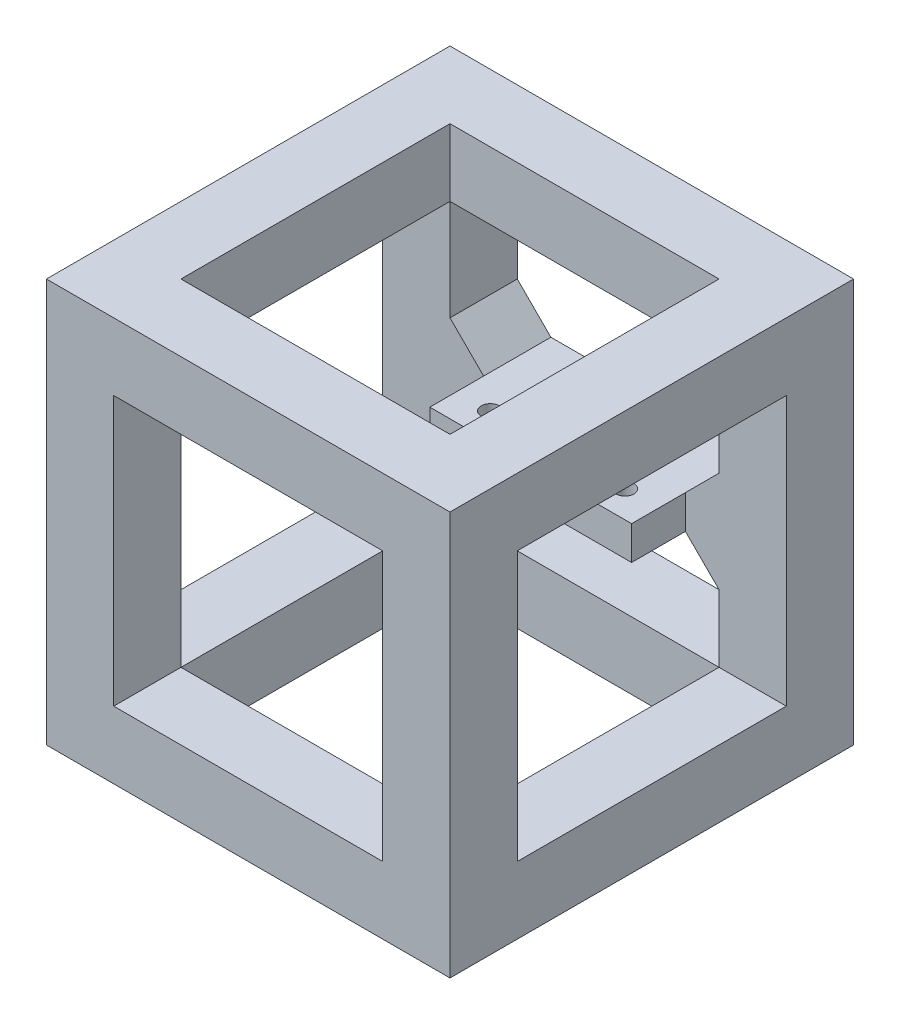
ISO-10303-21;
HEADER;
FILE_DESCRIPTION(('STEP AP214'),'2;1');
FILE_NAME('part.step','',(''),(''),'','','');
FILE_SCHEMA(('AUTOMOTIVE_DESIGN { 1 0 10303 214 1 1 1 1 }'));
ENDSEC;
DATA;
#1=APPLICATION_CONTEXT('core data for automotive mechanical design processes');
#2=APPLICATION_PROTOCOL_DEFINITION('international standard','automotive_design',2000,#1);
#3=PRODUCT_CONTEXT('',#1,'mechanical');
#4=PRODUCT('Part','Part','',(#3));
#5=PRODUCT_RELATED_PRODUCT_CATEGORY('part','',(#4));
#6=PRODUCT_DEFINITION_FORMATION('','',#4);
#7=PRODUCT_DEFINITION_CONTEXT('part definition',#1,'design');
#8=PRODUCT_DEFINITION('design','',#6,#7);
#9=PRODUCT_DEFINITION_SHAPE('','',#8);
#10=(LENGTH_UNIT() NAMED_UNIT(*) SI_UNIT(.MILLI.,.METRE.));
#11=(NAMED_UNIT(*) PLANE_ANGLE_UNIT() SI_UNIT($,.RADIAN.));
#12=(NAMED_UNIT(*) SI_UNIT($,.STERADIAN.) SOLID_ANGLE_UNIT());
#13=UNCERTAINTY_MEASURE_WITH_UNIT(LENGTH_MEASURE(1.E-05),#10,'distance_accuracy_value','');
#14=(GEOMETRIC_REPRESENTATION_CONTEXT(3) GLOBAL_UNCERTAINTY_ASSIGNED_CONTEXT((#13)) GLOBAL_UNIT_ASSIGNED_CONTEXT((#10,
#11,#12)) REPRESENTATION_CONTEXT('',''));
#15=CARTESIAN_POINT('',(0.,0.,0.));
#16=DIRECTION('',(0.,0.,1.));
#17=DIRECTION('',(1.,0.,0.));
#18=AXIS2_PLACEMENT_3D('',#15,#16,#17);
#19=CARTESIAN_POINT('',(20.,-25.,-4.00000000000001));
#20=DIRECTION('',(0.,0.,-1.));
#21=DIRECTION('',(-1.,0.,0.));
#22=AXIS2_PLACEMENT_3D('',#19,#20,#21);
#23=PLANE('',#22);
#24=DIRECTION('',(0.,1.,0.));
#25=VECTOR('',#24,1.);
#26=CARTESIAN_POINT('',(20.,25.,-4.00000000000001));
#27=LINE('',#26,#25);
#28=CARTESIAN_POINT('',(20.,10.,-4.00000000000001));
#29=VERTEX_POINT('',#28);
#30=CARTESIAN_POINT('',(20.,25.,-4.00000000000001));
#31=VERTEX_POINT('',#30);
#32=EDGE_CURVE('E260',#29,#31,#27,.T.);
#33=ORIENTED_EDGE('',*,*,#32,.F.);
#34=DIRECTION('',(-0.707106781186544,-0.707106781186552,0.));
#35=VECTOR('',#34,1.);
#36=CARTESIAN_POINT('',(2.5,-7.5000000000002,-4.00000000000001));
#37=LINE('',#36,#35);
#38=CARTESIAN_POINT('',(15.,5.,-4.00000000000001));
#39=VERTEX_POINT('',#38);
#40=EDGE_CURVE('E605',#29,#39,#37,.T.);
#41=ORIENTED_EDGE('',*,*,#40,.T.);
#42=DIRECTION('',(0.,-1.,0.));
#43=VECTOR('',#42,1.);
#44=CARTESIAN_POINT('',(15.,5.,-4.00000000000001));
#45=LINE('',#44,#43);
#46=CARTESIAN_POINT('',(15.,0.,-4.00000000000001));
#47=VERTEX_POINT('',#46);
#48=EDGE_CURVE('E520',#39,#47,#45,.T.);
#49=ORIENTED_EDGE('',*,*,#48,.T.);
#50=DIRECTION('',(-0.70710678118655,0.707106781186545,0.));
#51=VECTOR('',#50,1.);
#52=CARTESIAN_POINT('',(30.,-14.9999999999999,-4.00000000000001));
#53=LINE('',#52,#51);
#54=CARTESIAN_POINT('',(20.,-4.99999999999999,-4.00000000000001));
#55=VERTEX_POINT('',#54);
#56=EDGE_CURVE('E51',#47,#55,#53,.F.);
#57=ORIENTED_EDGE('',*,*,#56,.T.);
#58=DIRECTION('',(0.,1.,0.));
#59=VECTOR('',#58,1.);
#60=CARTESIAN_POINT('',(20.,0.,-4.00000000000001));
#61=LINE('',#60,#59);
#62=CARTESIAN_POINT('',(20.,-15.,-4.00000000000001));
#63=VERTEX_POINT('',#62);
#64=EDGE_CURVE('E303',#63,#55,#61,.T.);
#65=ORIENTED_EDGE('',*,*,#64,.F.);
#66=DIRECTION('',(1.,0.,0.));
#67=VECTOR('',#66,1.);
#68=CARTESIAN_POINT('',(20.,-15.,-4.00000000000001));
#69=LINE('',#68,#67);
#70=CARTESIAN_POINT('',(30.,-15.,-4.00000000000002));
#71=VERTEX_POINT('',#70);
#72=EDGE_CURVE('E351',#63,#71,#69,.T.);
#73=ORIENTED_EDGE('',*,*,#72,.T.);
#74=DIRECTION('',(0.,1.,0.));
#75=VECTOR('',#74,1.);
#76=CARTESIAN_POINT('',(30.,-15.,-4.00000000000002));
#77=LINE('',#76,#75);
#78=CARTESIAN_POINT('',(30.,25.,-4.00000000000002));
#79=VERTEX_POINT('',#78);
#80=EDGE_CURVE('E337',#71,#79,#77,.T.);
#81=ORIENTED_EDGE('',*,*,#80,.T.);
#82=DIRECTION('',(1.,0.,0.));
#83=VECTOR('',#82,1.);
#84=CARTESIAN_POINT('',(20.,25.,-4.00000000000001));
#85=LINE('',#84,#83);
#86=EDGE_CURVE('E348',#31,#79,#85,.T.);
#87=ORIENTED_EDGE('',*,*,#86,.F.);
#88=EDGE_LOOP('',(#33,#41,#49,#57,#65,#73,#81,#87));
#89=FACE_BOUND('',#88,.T.);
#90=ADVANCED_FACE('F41',(#89),#23,.F.);
#91=DIRECTION('',(0.,1.,0.));
#92=VECTOR('',#91,1.);
#93=CARTESIAN_POINT('',(-20.,-25.,-4.));
#94=LINE('',#93,#92);
#95=CARTESIAN_POINT('',(-20.,25.,-4.00000000000001));
#96=VERTEX_POINT('',#95);
#97=CARTESIAN_POINT('',(-20.,35.,-4.));
#98=VERTEX_POINT('',#97);
#99=EDGE_CURVE('E491',#96,#98,#94,.T.);
#100=ORIENTED_EDGE('',*,*,#99,.F.);
#101=DIRECTION('',(-1.,0.,0.));
#102=VECTOR('',#101,1.);
#103=CARTESIAN_POINT('',(-20.,25.,-4.00000000000001));
#104=LINE('',#103,#102);
#105=EDGE_CURVE('E280',#31,#96,#104,.T.);
#106=ORIENTED_EDGE('',*,*,#105,.F.);
#107=DIRECTION('',(0.,1.,0.));
#108=VECTOR('',#107,1.);
#109=CARTESIAN_POINT('',(20.,-25.,-4.00000000000001));
#110=LINE('',#109,#108);
#111=CARTESIAN_POINT('',(20.,35.,-4.00000000000001));
#112=VERTEX_POINT('',#111);
#113=EDGE_CURVE('E496',#31,#112,#110,.T.);
#114=ORIENTED_EDGE('',*,*,#113,.T.);
#115=DIRECTION('',(-1.,0.,0.));
#116=VECTOR('',#115,1.);
#117=CARTESIAN_POINT('',(20.,35.,-4.00000000000001));
#118=LINE('',#117,#116);
#119=EDGE_CURVE('E440',#112,#98,#118,.T.);
#120=ORIENTED_EDGE('',*,*,#119,.T.);
#121=EDGE_LOOP('',(#100,#106,#114,#120));
#122=FACE_BOUND('',#121,.T.);
#123=ADVANCED_FACE('F643',(#122),#23,.F.);
#124=DIRECTION('',(0.,1.,0.));
#125=VECTOR('',#124,1.);
#126=CARTESIAN_POINT('',(-15.,5.,-4.00000000000001));
#127=LINE('',#126,#125);
#128=CARTESIAN_POINT('',(-15.,0.,-4.00000000000001));
#129=VERTEX_POINT('',#128);
#130=CARTESIAN_POINT('',(-15.,5.,-4.00000000000001));
#131=VERTEX_POINT('',#130);
#132=EDGE_CURVE('E575',#129,#131,#127,.T.);
#133=ORIENTED_EDGE('',*,*,#132,.T.);
#134=DIRECTION('',(-0.707106781186551,0.707106781186544,0.));
#135=VECTOR('',#134,1.);
#136=CARTESIAN_POINT('',(17.5000000000002,-27.4999999999998,-4.00000000000001));
#137=LINE('',#136,#135);
#138=CARTESIAN_POINT('',(-20.,9.99999999999999,-4.00000000000001));
#139=VERTEX_POINT('',#138);
#140=EDGE_CURVE('E610',#131,#139,#137,.T.);
#141=ORIENTED_EDGE('',*,*,#140,.T.);
#142=DIRECTION('',(0.,-1.,0.));
#143=VECTOR('',#142,1.);
#144=CARTESIAN_POINT('',(-20.,25.,-4.00000000000001));
#145=LINE('',#144,#143);
#146=EDGE_CURVE('E273',#96,#139,#145,.T.);
#147=ORIENTED_EDGE('',*,*,#146,.F.);
#148=DIRECTION('',(-1.,0.,0.));
#149=VECTOR('',#148,1.);
#150=CARTESIAN_POINT('',(-20.,25.,-4.));
#151=LINE('',#150,#149);
#152=CARTESIAN_POINT('',(-30.,25.,-4.));
#153=VERTEX_POINT('',#152);
#154=EDGE_CURVE('E391',#96,#153,#151,.T.);
#155=ORIENTED_EDGE('',*,*,#154,.T.);
#156=DIRECTION('',(0.,-1.,0.));
#157=VECTOR('',#156,1.);
#158=CARTESIAN_POINT('',(-30.,25.,-4.));
#159=LINE('',#158,#157);
#160=CARTESIAN_POINT('',(-30.,-15.,-4.));
#161=VERTEX_POINT('',#160);
#162=EDGE_CURVE('E377',#153,#161,#159,.T.);
#163=ORIENTED_EDGE('',*,*,#162,.T.);
#164=DIRECTION('',(-1.,0.,0.));
#165=VECTOR('',#164,1.);
#166=CARTESIAN_POINT('',(-20.,-15.,-4.));
#167=LINE('',#166,#165);
#168=CARTESIAN_POINT('',(-20.,-15.,-4.00000000000001));
#169=VERTEX_POINT('',#168);
#170=EDGE_CURVE('E388',#169,#161,#167,.T.);
#171=ORIENTED_EDGE('',*,*,#170,.F.);
#172=DIRECTION('',(0.,-1.,0.));
#173=VECTOR('',#172,1.);
#174=CARTESIAN_POINT('',(-20.,0.,-4.00000000000001));
#175=LINE('',#174,#173);
#176=CARTESIAN_POINT('',(-20.,-5.00000000000005,-4.00000000000001));
#177=VERTEX_POINT('',#176);
#178=EDGE_CURVE('E306',#177,#169,#175,.T.);
#179=ORIENTED_EDGE('',*,*,#178,.F.);
#180=DIRECTION('',(-0.707106781186544,-0.707106781186551,0.));
#181=VECTOR('',#180,1.);
#182=CARTESIAN_POINT('',(-10.0000000000002,4.99999999999987,-4.00000000000001));
#183=LINE('',#182,#181);
#184=EDGE_CURVE('E616',#177,#129,#183,.F.);
#185=ORIENTED_EDGE('',*,*,#184,.T.);
#186=EDGE_LOOP('',(#133,#141,#147,#155,#163,#171,#179,#185));
#187=FACE_BOUND('',#186,.T.);
#188=ADVANCED_FACE('F700',(#187),#23,.F.);
#189=CARTESIAN_POINT('',(20.,-25.,-4.00000000000001));
#190=DIRECTION('',(1.,0.,0.));
#191=DIRECTION('',(0.,0.,-1.));
#192=AXIS2_PLACEMENT_3D('',#189,#190,#191);
#193=PLANE('',#192);
#194=ORIENTED_EDGE('',*,*,#113,.F.);
#195=DIRECTION('',(0.,0.,1.));
#196=VECTOR('',#195,1.);
#197=CARTESIAN_POINT('',(20.,25.,-4.00000000000001));
#198=LINE('',#197,#196);
#199=CARTESIAN_POINT('',(20.,25.,36.));
#200=VERTEX_POINT('',#199);
#201=EDGE_CURVE('E326',#31,#200,#198,.T.);
#202=ORIENTED_EDGE('',*,*,#201,.T.);
#203=DIRECTION('',(0.,1.,0.));
#204=VECTOR('',#203,1.);
#205=CARTESIAN_POINT('',(20.,-25.,36.));
#206=LINE('',#205,#204);
#207=CARTESIAN_POINT('',(20.,35.,36.));
#208=VERTEX_POINT('',#207);
#209=EDGE_CURVE('E480',#200,#208,#206,.T.);
#210=ORIENTED_EDGE('',*,*,#209,.T.);
#211=DIRECTION('',(0.,0.,-1.));
#212=VECTOR('',#211,1.);
#213=CARTESIAN_POINT('',(20.,35.,-4.00000000000001));
#214=LINE('',#213,#212);
#215=EDGE_CURVE('E436',#208,#112,#214,.T.);
#216=ORIENTED_EDGE('',*,*,#215,.T.);
#217=EDGE_LOOP('',(#194,#202,#210,#216));
#218=FACE_BOUND('',#217,.T.);
#219=ADVANCED_FACE('F629',(#218),#193,.F.);
#220=DIRECTION('',(0.,0.,1.));
#221=VECTOR('',#220,1.);
#222=CARTESIAN_POINT('',(20.,25.,36.));
#223=LINE('',#222,#221);
#224=CARTESIAN_POINT('',(20.,25.,46.));
#225=VERTEX_POINT('',#224);
#226=EDGE_CURVE('E406',#200,#225,#223,.T.);
#227=ORIENTED_EDGE('',*,*,#226,.F.);
#228=DIRECTION('',(0.,-1.,0.));
#229=VECTOR('',#228,1.);
#230=CARTESIAN_POINT('',(20.,-15.,36.));
#231=LINE('',#230,#229);
#232=CARTESIAN_POINT('',(20.,-15.,36.));
#233=VERTEX_POINT('',#232);
#234=EDGE_CURVE('E317',#200,#233,#231,.T.);
#235=ORIENTED_EDGE('',*,*,#234,.T.);
#236=DIRECTION('',(0.,0.,1.));
#237=VECTOR('',#236,1.);
#238=CARTESIAN_POINT('',(20.,-15.,36.));
#239=LINE('',#238,#237);
#240=CARTESIAN_POINT('',(20.,-15.,46.));
#241=VERTEX_POINT('',#240);
#242=EDGE_CURVE('E420',#233,#241,#239,.T.);
#243=ORIENTED_EDGE('',*,*,#242,.T.);
#244=DIRECTION('',(0.,1.,0.));
#245=VECTOR('',#244,1.);
#246=CARTESIAN_POINT('',(20.,25.,46.));
#247=LINE('',#246,#245);
#248=EDGE_CURVE('E387',#241,#225,#247,.T.);
#249=ORIENTED_EDGE('',*,*,#248,.T.);
#250=EDGE_LOOP('',(#227,#235,#243,#249));
#251=FACE_BOUND('',#250,.T.);
#252=ADVANCED_FACE('F658',(#251),#193,.F.);
#253=CARTESIAN_POINT('',(-20.,-25.,-4.));
#254=DIRECTION('',(-1.,0.,0.));
#255=DIRECTION('',(0.,0.,1.));
#256=AXIS2_PLACEMENT_3D('',#253,#254,#255);
#257=PLANE('',#256);
#258=CARTESIAN_POINT('',(-20.,-25.,-4.));
#259=VERTEX_POINT('',#258);
#260=EDGE_CURVE('E487',#259,#169,#94,.T.);
#261=ORIENTED_EDGE('',*,*,#260,.T.);
#262=DIRECTION('',(0.,0.,1.));
#263=VECTOR('',#262,1.);
#264=CARTESIAN_POINT('',(-20.,-15.,-4.));
#265=LINE('',#264,#263);
#266=CARTESIAN_POINT('',(-20.,-15.,36.));
#267=VERTEX_POINT('',#266);
#268=EDGE_CURVE('E366',#169,#267,#265,.T.);
#269=ORIENTED_EDGE('',*,*,#268,.T.);
#270=DIRECTION('',(0.,1.,0.));
#271=VECTOR('',#270,1.);
#272=CARTESIAN_POINT('',(-20.,-25.,36.));
#273=LINE('',#272,#271);
#274=CARTESIAN_POINT('',(-20.,-25.,36.));
#275=VERTEX_POINT('',#274);
#276=EDGE_CURVE('E481',#275,#267,#273,.T.);
#277=ORIENTED_EDGE('',*,*,#276,.F.);
#278=DIRECTION('',(0.,0.,1.));
#279=VECTOR('',#278,1.);
#280=CARTESIAN_POINT('',(-20.,-25.,-4.));
#281=LINE('',#280,#279);
#282=EDGE_CURVE('E476',#259,#275,#281,.T.);
#283=ORIENTED_EDGE('',*,*,#282,.F.);
#284=EDGE_LOOP('',(#261,#269,#277,#283));
#285=FACE_BOUND('',#284,.T.);
#286=ADVANCED_FACE('F676',(#285),#257,.F.);
#287=DIRECTION('',(0.,0.,1.));
#288=VECTOR('',#287,1.);
#289=CARTESIAN_POINT('',(-20.,-15.,36.));
#290=LINE('',#289,#288);
#291=CARTESIAN_POINT('',(-20.,-15.,46.));
#292=VERTEX_POINT('',#291);
#293=EDGE_CURVE('E424',#267,#292,#290,.T.);
#294=ORIENTED_EDGE('',*,*,#293,.F.);
#295=DIRECTION('',(0.,1.,0.));
#296=VECTOR('',#295,1.);
#297=CARTESIAN_POINT('',(-20.,25.,36.));
#298=LINE('',#297,#296);
#299=CARTESIAN_POINT('',(-20.,25.,36.));
#300=VERTEX_POINT('',#299);
#301=EDGE_CURVE('E357',#267,#300,#298,.T.);
#302=ORIENTED_EDGE('',*,*,#301,.T.);
#303=DIRECTION('',(0.,0.,1.));
#304=VECTOR('',#303,1.);
#305=CARTESIAN_POINT('',(-20.,25.,36.));
#306=LINE('',#305,#304);
#307=CARTESIAN_POINT('',(-20.,25.,46.));
#308=VERTEX_POINT('',#307);
#309=EDGE_CURVE('E427',#300,#308,#306,.T.);
#310=ORIENTED_EDGE('',*,*,#309,.T.);
#311=DIRECTION('',(0.,-1.,0.));
#312=VECTOR('',#311,1.);
#313=CARTESIAN_POINT('',(-20.,25.,46.));
#314=LINE('',#313,#312);
#315=EDGE_CURVE('E413',#308,#292,#314,.T.);
#316=ORIENTED_EDGE('',*,*,#315,.T.);
#317=EDGE_LOOP('',(#294,#302,#310,#316));
#318=FACE_BOUND('',#317,.T.);
#319=ADVANCED_FACE('F681',(#318),#257,.F.);
#320=CARTESIAN_POINT('',(-20.,-25.,36.));
#321=DIRECTION('',(0.,0.,1.));
#322=DIRECTION('',(1.,0.,0.));
#323=AXIS2_PLACEMENT_3D('',#320,#321,#322);
#324=PLANE('',#323);
#325=ORIENTED_EDGE('',*,*,#276,.T.);
#326=DIRECTION('',(1.,0.,0.));
#327=VECTOR('',#326,1.);
#328=CARTESIAN_POINT('',(-20.,-15.,36.));
#329=LINE('',#328,#327);
#330=EDGE_CURVE('E401',#267,#233,#329,.T.);
#331=ORIENTED_EDGE('',*,*,#330,.T.);
#332=CARTESIAN_POINT('',(20.,-25.,36.));
#333=VERTEX_POINT('',#332);
#334=EDGE_CURVE('E497',#333,#233,#206,.T.);
#335=ORIENTED_EDGE('',*,*,#334,.F.);
#336=DIRECTION('',(1.,0.,0.));
#337=VECTOR('',#336,1.);
#338=CARTESIAN_POINT('',(-20.,-25.,36.));
#339=LINE('',#338,#337);
#340=EDGE_CURVE('E464',#275,#333,#339,.T.);
#341=ORIENTED_EDGE('',*,*,#340,.F.);
#342=EDGE_LOOP('',(#325,#331,#335,#341));
#343=FACE_BOUND('',#342,.T.);
#344=ADVANCED_FACE('F665',(#343),#324,.F.);
#345=CARTESIAN_POINT('',(0.,5.,0.));
#346=DIRECTION('',(0.,1.,0.));
#347=DIRECTION('',(0.,0.,1.));
#348=AXIS2_PLACEMENT_3D('',#345,#346,#347);
#349=PLANE('',#348);
#350=CARTESIAN_POINT('',(-10.,5.,0.));
#351=DIRECTION('',(0.,1.,0.));
#352=DIRECTION('',(0.,0.,1.));
#353=AXIS2_PLACEMENT_3D('',#350,#351,#352);
#354=CIRCLE('',#353,1.35);
#355=CARTESIAN_POINT('',(-10.,5.,1.35));
#356=VERTEX_POINT('',#355);
#357=EDGE_CURVE('E540',#356,#356,#354,.T.);
#358=ORIENTED_EDGE('',*,*,#357,.F.);
#359=EDGE_LOOP('',(#358));
#360=FACE_BOUND('',#359,.T.);
#361=CARTESIAN_POINT('',(10.,5.,0.));
#362=DIRECTION('',(0.,1.,0.));
#363=DIRECTION('',(0.,0.,1.));
#364=AXIS2_PLACEMENT_3D('',#361,#362,#363);
#365=CIRCLE('',#364,1.35);
#366=CARTESIAN_POINT('',(10.,5.,1.35));
#367=VERTEX_POINT('',#366);
#368=EDGE_CURVE('E532',#367,#367,#365,.T.);
#369=ORIENTED_EDGE('',*,*,#368,.F.);
#370=EDGE_LOOP('',(#369));
#371=FACE_BOUND('',#370,.T.);
#372=DIRECTION('',(0.,0.,-1.));
#373=VECTOR('',#372,1.);
#374=CARTESIAN_POINT('',(15.,5.,-14.));
#375=LINE('',#374,#373);
#376=CARTESIAN_POINT('',(15.,5.,4.));
#377=VERTEX_POINT('',#376);
#378=EDGE_CURVE('E548',#377,#39,#375,.T.);
#379=ORIENTED_EDGE('',*,*,#378,.T.);
#380=DIRECTION('',(0.,0.,-1.));
#381=VECTOR('',#380,1.);
#382=CARTESIAN_POINT('',(15.,5.,0.));
#383=LINE('',#382,#381);
#384=CARTESIAN_POINT('',(15.,5.,-14.));
#385=VERTEX_POINT('',#384);
#386=EDGE_CURVE('E586',#39,#385,#383,.T.);
#387=ORIENTED_EDGE('',*,*,#386,.T.);
#388=DIRECTION('',(1.,0.,0.));
#389=VECTOR('',#388,1.);
#390=CARTESIAN_POINT('',(-20.,5.,-14.));
#391=LINE('',#390,#389);
#392=CARTESIAN_POINT('',(-14.9999999999999,5.,-14.));
#393=VERTEX_POINT('',#392);
#394=EDGE_CURVE('E254',#393,#385,#391,.T.);
#395=ORIENTED_EDGE('',*,*,#394,.F.);
#396=DIRECTION('',(0.,0.,1.));
#397=VECTOR('',#396,1.);
#398=CARTESIAN_POINT('',(-14.9999999999999,5.,0.));
#399=LINE('',#398,#397);
#400=EDGE_CURVE('E582',#393,#131,#399,.T.);
#401=ORIENTED_EDGE('',*,*,#400,.T.);
#402=DIRECTION('',(0.,0.,1.));
#403=VECTOR('',#402,1.);
#404=CARTESIAN_POINT('',(-15.,5.,-14.));
#405=LINE('',#404,#403);
#406=CARTESIAN_POINT('',(-15.,5.,4.));
#407=VERTEX_POINT('',#406);
#408=EDGE_CURVE('E552',#131,#407,#405,.T.);
#409=ORIENTED_EDGE('',*,*,#408,.T.);
#410=DIRECTION('',(1.,0.,0.));
#411=VECTOR('',#410,1.);
#412=CARTESIAN_POINT('',(-15.,5.,4.));
#413=LINE('',#412,#411);
#414=EDGE_CURVE('E556',#407,#377,#413,.T.);
#415=ORIENTED_EDGE('',*,*,#414,.T.);
#416=EDGE_LOOP('',(#379,#387,#395,#401,#409,#415));
#417=FACE_BOUND('',#416,.T.);
#418=ADVANCED_FACE('F712',(#360,#371,#417),#349,.T.);
#419=CARTESIAN_POINT('',(0.,0.,0.));
#420=DIRECTION('',(0.,1.,0.));
#421=DIRECTION('',(0.,0.,1.));
#422=AXIS2_PLACEMENT_3D('',#419,#420,#421);
#423=PLANE('',#422);
#424=CARTESIAN_POINT('',(10.,0.,0.));
#425=DIRECTION('',(0.,1.,0.));
#426=DIRECTION('',(0.,0.,1.));
#427=AXIS2_PLACEMENT_3D('',#424,#425,#426);
#428=CIRCLE('',#427,1.35);
#429=CARTESIAN_POINT('',(10.,0.,1.35));
#430=VERTEX_POINT('',#429);
#431=EDGE_CURVE('E531',#430,#430,#428,.T.);
#432=ORIENTED_EDGE('',*,*,#431,.T.);
#433=EDGE_LOOP('',(#432));
#434=FACE_BOUND('',#433,.T.);
#435=CARTESIAN_POINT('',(-10.,0.,0.));
#436=DIRECTION('',(0.,1.,0.));
#437=DIRECTION('',(0.,0.,1.));
#438=AXIS2_PLACEMENT_3D('',#435,#436,#437);
#439=CIRCLE('',#438,1.35);
#440=CARTESIAN_POINT('',(-10.,0.,1.35));
#441=VERTEX_POINT('',#440);
#442=EDGE_CURVE('E536',#441,#441,#439,.T.);
#443=ORIENTED_EDGE('',*,*,#442,.T.);
#444=EDGE_LOOP('',(#443));
#445=FACE_BOUND('',#444,.T.);
#446=DIRECTION('',(0.,0.,1.));
#447=VECTOR('',#446,1.);
#448=CARTESIAN_POINT('',(-15.,0.,-14.));
#449=LINE('',#448,#447);
#450=CARTESIAN_POINT('',(-15.,0.,4.));
#451=VERTEX_POINT('',#450);
#452=EDGE_CURVE('E563',#129,#451,#449,.T.);
#453=ORIENTED_EDGE('',*,*,#452,.F.);
#454=DIRECTION('',(0.,0.,-1.));
#455=VECTOR('',#454,1.);
#456=CARTESIAN_POINT('',(-15.,0.,-14.));
#457=LINE('',#456,#455);
#458=CARTESIAN_POINT('',(-15.,0.,-14.));
#459=VERTEX_POINT('',#458);
#460=EDGE_CURVE('E600',#129,#459,#457,.T.);
#461=ORIENTED_EDGE('',*,*,#460,.T.);
#462=DIRECTION('',(-1.,0.,0.));
#463=VECTOR('',#462,1.);
#464=CARTESIAN_POINT('',(20.,0.,-14.));
#465=LINE('',#464,#463);
#466=CARTESIAN_POINT('',(15.,0.,-14.));
#467=VERTEX_POINT('',#466);
#468=EDGE_CURVE('E290',#467,#459,#465,.T.);
#469=ORIENTED_EDGE('',*,*,#468,.F.);
#470=DIRECTION('',(0.,0.,1.));
#471=VECTOR('',#470,1.);
#472=CARTESIAN_POINT('',(15.,0.,-4.00000000000001));
#473=LINE('',#472,#471);
#474=EDGE_CURVE('E596',#467,#47,#473,.T.);
#475=ORIENTED_EDGE('',*,*,#474,.T.);
#476=DIRECTION('',(0.,0.,-1.));
#477=VECTOR('',#476,1.);
#478=CARTESIAN_POINT('',(15.,0.,-14.));
#479=LINE('',#478,#477);
#480=CARTESIAN_POINT('',(15.,0.,4.));
#481=VERTEX_POINT('',#480);
#482=EDGE_CURVE('E544',#481,#47,#479,.T.);
#483=ORIENTED_EDGE('',*,*,#482,.F.);
#484=DIRECTION('',(1.,0.,0.));
#485=VECTOR('',#484,1.);
#486=CARTESIAN_POINT('',(-15.,0.,4.));
#487=LINE('',#486,#485);
#488=EDGE_CURVE('E553',#451,#481,#487,.T.);
#489=ORIENTED_EDGE('',*,*,#488,.F.);
#490=EDGE_LOOP('',(#453,#461,#469,#475,#483,#489));
#491=FACE_BOUND('',#490,.T.);
#492=ADVANCED_FACE('F729',(#434,#445,#491),#423,.F.);
#493=CARTESIAN_POINT('',(15.,5.,-14.));
#494=DIRECTION('',(-1.,0.,0.));
#495=DIRECTION('',(0.,0.,1.));
#496=AXIS2_PLACEMENT_3D('',#493,#494,#495);
#497=PLANE('',#496);
#498=ORIENTED_EDGE('',*,*,#48,.F.);
#499=ORIENTED_EDGE('',*,*,#378,.F.);
#500=DIRECTION('',(0.,-1.,0.));
#501=VECTOR('',#500,1.);
#502=CARTESIAN_POINT('',(15.,5.,4.));
#503=LINE('',#502,#501);
#504=EDGE_CURVE('E559',#377,#481,#503,.T.);
#505=ORIENTED_EDGE('',*,*,#504,.T.);
#506=ORIENTED_EDGE('',*,*,#482,.T.);
#507=EDGE_LOOP('',(#498,#499,#505,#506));
#508=FACE_BOUND('',#507,.T.);
#509=ADVANCED_FACE('F723',(#508),#497,.F.);
#510=CARTESIAN_POINT('',(-15.,5.,-14.));
#511=DIRECTION('',(1.,0.,0.));
#512=DIRECTION('',(0.,0.,-1.));
#513=AXIS2_PLACEMENT_3D('',#510,#511,#512);
#514=PLANE('',#513);
#515=ORIENTED_EDGE('',*,*,#132,.F.);
#516=ORIENTED_EDGE('',*,*,#452,.T.);
#517=DIRECTION('',(0.,-1.,0.));
#518=VECTOR('',#517,1.);
#519=CARTESIAN_POINT('',(-15.,5.,4.));
#520=LINE('',#519,#518);
#521=EDGE_CURVE('E571',#407,#451,#520,.T.);
#522=ORIENTED_EDGE('',*,*,#521,.F.);
#523=ORIENTED_EDGE('',*,*,#408,.F.);
#524=EDGE_LOOP('',(#515,#516,#522,#523));
#525=FACE_BOUND('',#524,.T.);
#526=ADVANCED_FACE('F828',(#525),#514,.F.);
#527=CARTESIAN_POINT('',(-15.,5.,4.));
#528=DIRECTION('',(0.,0.,-1.));
#529=DIRECTION('',(-1.,0.,0.));
#530=AXIS2_PLACEMENT_3D('',#527,#528,#529);
#531=PLANE('',#530);
#532=ORIENTED_EDGE('',*,*,#488,.T.);
#533=ORIENTED_EDGE('',*,*,#504,.F.);
#534=ORIENTED_EDGE('',*,*,#414,.F.);
#535=ORIENTED_EDGE('',*,*,#521,.T.);
#536=EDGE_LOOP('',(#532,#533,#534,#535));
#537=FACE_BOUND('',#536,.T.);
#538=ADVANCED_FACE('F825',(#537),#531,.F.);
#539=CARTESIAN_POINT('',(-10.,5.,0.));
#540=DIRECTION('',(0.,-1.,0.));
#541=DIRECTION('',(0.,0.,-1.));
#542=AXIS2_PLACEMENT_3D('',#539,#540,#541);
#543=CYLINDRICAL_SURFACE('',#542,1.35);
#544=ORIENTED_EDGE('',*,*,#357,.T.);
#545=EDGE_LOOP('',(#544));
#546=FACE_BOUND('',#545,.T.);
#547=ORIENTED_EDGE('',*,*,#442,.F.);
#548=EDGE_LOOP('',(#547));
#549=FACE_BOUND('',#548,.T.);
#550=ADVANCED_FACE('F786',(#546,#549),#543,.F.);
#551=CARTESIAN_POINT('',(10.,5.,0.));
#552=DIRECTION('',(0.,-1.,0.));
#553=DIRECTION('',(0.,0.,-1.));
#554=AXIS2_PLACEMENT_3D('',#551,#552,#553);
#555=CYLINDRICAL_SURFACE('',#554,1.35);
#556=ORIENTED_EDGE('',*,*,#368,.T.);
#557=EDGE_LOOP('',(#556));
#558=FACE_BOUND('',#557,.T.);
#559=ORIENTED_EDGE('',*,*,#431,.F.);
#560=EDGE_LOOP('',(#559));
#561=FACE_BOUND('',#560,.T.);
#562=ADVANCED_FACE('F782',(#558,#561),#555,.F.);
#563=CARTESIAN_POINT('',(20.,-25.,-4.00000000000001));
#564=VERTEX_POINT('',#563);
#565=EDGE_CURVE('E492',#564,#63,#110,.T.);
#566=ORIENTED_EDGE('',*,*,#565,.T.);
#567=DIRECTION('',(1.,0.,0.));
#568=VECTOR('',#567,1.);
#569=CARTESIAN_POINT('',(20.,-15.,-4.00000000000001));
#570=LINE('',#569,#568);
#571=EDGE_CURVE('E291',#169,#63,#570,.T.);
#572=ORIENTED_EDGE('',*,*,#571,.F.);
#573=ORIENTED_EDGE('',*,*,#260,.F.);
#574=DIRECTION('',(-1.,0.,0.));
#575=VECTOR('',#574,1.);
#576=CARTESIAN_POINT('',(20.,-25.,-4.00000000000001));
#577=LINE('',#576,#575);
#578=EDGE_CURVE('E472',#564,#259,#577,.T.);
#579=ORIENTED_EDGE('',*,*,#578,.F.);
#580=EDGE_LOOP('',(#566,#572,#573,#579));
#581=FACE_BOUND('',#580,.T.);
#582=ADVANCED_FACE('F751',(#581),#23,.F.);
#583=CARTESIAN_POINT('',(30.,-25.,-14.));
#584=DIRECTION('',(1.,0.,0.));
#585=DIRECTION('',(0.,0.,-1.));
#586=AXIS2_PLACEMENT_3D('',#583,#584,#585);
#587=PLANE('',#586);
#588=DIRECTION('',(0.,-1.,0.));
#589=VECTOR('',#588,1.);
#590=CARTESIAN_POINT('',(30.,-15.,36.));
#591=LINE('',#590,#589);
#592=CARTESIAN_POINT('',(30.,25.,36.));
#593=VERTEX_POINT('',#592);
#594=CARTESIAN_POINT('',(30.,-15.,36.));
#595=VERTEX_POINT('',#594);
#596=EDGE_CURVE('E285',#593,#595,#591,.T.);
#597=ORIENTED_EDGE('',*,*,#596,.F.);
#598=DIRECTION('',(0.,0.,1.));
#599=VECTOR('',#598,1.);
#600=CARTESIAN_POINT('',(30.,25.,-4.00000000000002));
#601=LINE('',#600,#599);
#602=EDGE_CURVE('E322',#79,#593,#601,.T.);
#603=ORIENTED_EDGE('',*,*,#602,.F.);
#604=ORIENTED_EDGE('',*,*,#80,.F.);
#605=DIRECTION('',(0.,0.,-1.));
#606=VECTOR('',#605,1.);
#607=CARTESIAN_POINT('',(30.,-15.,-4.00000000000002));
#608=LINE('',#607,#606);
#609=EDGE_CURVE('E333',#595,#71,#608,.T.);
#610=ORIENTED_EDGE('',*,*,#609,.F.);
#611=EDGE_LOOP('',(#597,#603,#604,#610));
#612=FACE_BOUND('',#611,.T.);
#613=DIRECTION('',(0.,1.,0.));
#614=VECTOR('',#613,1.);
#615=CARTESIAN_POINT('',(30.,-25.,-14.));
#616=LINE('',#615,#614);
#617=CARTESIAN_POINT('',(30.,-25.,-14.));
#618=VERTEX_POINT('',#617);
#619=CARTESIAN_POINT('',(30.,35.,-14.));
#620=VERTEX_POINT('',#619);
#621=EDGE_CURVE('E516',#618,#620,#616,.T.);
#622=ORIENTED_EDGE('',*,*,#621,.T.);
#623=DIRECTION('',(0.,0.,-1.));
#624=VECTOR('',#623,1.);
#625=CARTESIAN_POINT('',(30.,35.,-14.));
#626=LINE('',#625,#624);
#627=CARTESIAN_POINT('',(30.,35.,46.));
#628=VERTEX_POINT('',#627);
#629=EDGE_CURVE('E448',#628,#620,#626,.T.);
#630=ORIENTED_EDGE('',*,*,#629,.F.);
#631=DIRECTION('',(0.,1.,0.));
#632=VECTOR('',#631,1.);
#633=CARTESIAN_POINT('',(30.,-25.,46.));
#634=LINE('',#633,#632);
#635=CARTESIAN_POINT('',(30.,-25.,46.));
#636=VERTEX_POINT('',#635);
#637=EDGE_CURVE('E517',#636,#628,#634,.T.);
#638=ORIENTED_EDGE('',*,*,#637,.F.);
#639=DIRECTION('',(0.,0.,-1.));
#640=VECTOR('',#639,1.);
#641=CARTESIAN_POINT('',(30.,-25.,-14.));
#642=LINE('',#641,#640);
#643=EDGE_CURVE('E485',#636,#618,#642,.T.);
#644=ORIENTED_EDGE('',*,*,#643,.T.);
#645=EDGE_LOOP('',(#622,#630,#638,#644));
#646=FACE_BOUND('',#645,.T.);
#647=ADVANCED_FACE('F748',(#612,#646),#587,.T.);
#648=CARTESIAN_POINT('',(-30.,-25.,46.));
#649=DIRECTION('',(0.,0.,1.));
#650=DIRECTION('',(1.,0.,0.));
#651=AXIS2_PLACEMENT_3D('',#648,#649,#650);
#652=PLANE('',#651);
#653=ORIENTED_EDGE('',*,*,#248,.F.);
#654=DIRECTION('',(1.,0.,0.));
#655=VECTOR('',#654,1.);
#656=CARTESIAN_POINT('',(-20.,-15.,46.));
#657=LINE('',#656,#655);
#658=EDGE_CURVE('E402',#292,#241,#657,.T.);
#659=ORIENTED_EDGE('',*,*,#658,.F.);
#660=ORIENTED_EDGE('',*,*,#315,.F.);
#661=DIRECTION('',(-1.,0.,0.));
#662=VECTOR('',#661,1.);
#663=CARTESIAN_POINT('',(-20.,25.,46.));
#664=LINE('',#663,#662);
#665=EDGE_CURVE('E409',#225,#308,#664,.T.);
#666=ORIENTED_EDGE('',*,*,#665,.F.);
#667=EDGE_LOOP('',(#653,#659,#660,#666));
#668=FACE_BOUND('',#667,.T.);
#669=ORIENTED_EDGE('',*,*,#637,.T.);
#670=DIRECTION('',(1.,0.,0.));
#671=VECTOR('',#670,1.);
#672=CARTESIAN_POINT('',(-30.,35.,46.));
#673=LINE('',#672,#671);
#674=CARTESIAN_POINT('',(-30.,35.,46.));
#675=VERTEX_POINT('',#674);
#676=EDGE_CURVE('E460',#675,#628,#673,.T.);
#677=ORIENTED_EDGE('',*,*,#676,.F.);
#678=DIRECTION('',(0.,1.,0.));
#679=VECTOR('',#678,1.);
#680=CARTESIAN_POINT('',(-30.,-25.,46.));
#681=LINE('',#680,#679);
#682=CARTESIAN_POINT('',(-30.,-25.,46.));
#683=VERTEX_POINT('',#682);
#684=EDGE_CURVE('E521',#683,#675,#681,.T.);
#685=ORIENTED_EDGE('',*,*,#684,.F.);
#686=DIRECTION('',(1.,0.,0.));
#687=VECTOR('',#686,1.);
#688=CARTESIAN_POINT('',(-30.,-25.,46.));
#689=LINE('',#688,#687);
#690=EDGE_CURVE('E512',#683,#636,#689,.T.);
#691=ORIENTED_EDGE('',*,*,#690,.T.);
#692=EDGE_LOOP('',(#669,#677,#685,#691));
#693=FACE_BOUND('',#692,.T.);
#694=ADVANCED_FACE('F687',(#668,#693),#652,.T.);
#695=CARTESIAN_POINT('',(-30.,-25.,-14.));
#696=DIRECTION('',(-1.,0.,0.));
#697=DIRECTION('',(0.,0.,1.));
#698=AXIS2_PLACEMENT_3D('',#695,#696,#697);
#699=PLANE('',#698);
#700=DIRECTION('',(0.,1.,0.));
#701=VECTOR('',#700,1.);
#702=CARTESIAN_POINT('',(-30.,25.,36.));
#703=LINE('',#702,#701);
#704=CARTESIAN_POINT('',(-30.,-15.,36.));
#705=VERTEX_POINT('',#704);
#706=CARTESIAN_POINT('',(-30.,25.,36.));
#707=VERTEX_POINT('',#706);
#708=EDGE_CURVE('E347',#705,#707,#703,.T.);
#709=ORIENTED_EDGE('',*,*,#708,.F.);
#710=DIRECTION('',(0.,0.,1.));
#711=VECTOR('',#710,1.);
#712=CARTESIAN_POINT('',(-30.,-15.,-4.));
#713=LINE('',#712,#711);
#714=EDGE_CURVE('E362',#161,#705,#713,.T.);
#715=ORIENTED_EDGE('',*,*,#714,.F.);
#716=ORIENTED_EDGE('',*,*,#162,.F.);
#717=DIRECTION('',(0.,0.,-1.));
#718=VECTOR('',#717,1.);
#719=CARTESIAN_POINT('',(-30.,25.,-4.));
#720=LINE('',#719,#718);
#721=EDGE_CURVE('E373',#707,#153,#720,.T.);
#722=ORIENTED_EDGE('',*,*,#721,.F.);
#723=EDGE_LOOP('',(#709,#715,#716,#722));
#724=FACE_BOUND('',#723,.T.);
#725=ORIENTED_EDGE('',*,*,#684,.T.);
#726=DIRECTION('',(0.,0.,1.));
#727=VECTOR('',#726,1.);
#728=CARTESIAN_POINT('',(-30.,35.,-14.));
#729=LINE('',#728,#727);
#730=CARTESIAN_POINT('',(-30.,35.,-14.));
#731=VERTEX_POINT('',#730);
#732=EDGE_CURVE('E456',#731,#675,#729,.T.);
#733=ORIENTED_EDGE('',*,*,#732,.F.);
#734=DIRECTION('',(0.,1.,0.));
#735=VECTOR('',#734,1.);
#736=CARTESIAN_POINT('',(-30.,-25.,-14.));
#737=LINE('',#736,#735);
#738=CARTESIAN_POINT('',(-30.,-25.,-14.));
#739=VERTEX_POINT('',#738);
#740=EDGE_CURVE('E524',#739,#731,#737,.T.);
#741=ORIENTED_EDGE('',*,*,#740,.F.);
#742=DIRECTION('',(0.,0.,1.));
#743=VECTOR('',#742,1.);
#744=CARTESIAN_POINT('',(-30.,-25.,-14.));
#745=LINE('',#744,#743);
#746=EDGE_CURVE('E508',#739,#683,#745,.T.);
#747=ORIENTED_EDGE('',*,*,#746,.T.);
#748=EDGE_LOOP('',(#725,#733,#741,#747));
#749=FACE_BOUND('',#748,.T.);
#750=ADVANCED_FACE('F763',(#724,#749),#699,.T.);
#751=CARTESIAN_POINT('',(0.,-25.,0.));
#752=DIRECTION('',(0.,1.,0.));
#753=DIRECTION('',(0.,0.,1.));
#754=AXIS2_PLACEMENT_3D('',#751,#752,#753);
#755=PLANE('',#754);
#756=ORIENTED_EDGE('',*,*,#282,.T.);
#757=ORIENTED_EDGE('',*,*,#340,.T.);
#758=DIRECTION('',(0.,0.,-1.));
#759=VECTOR('',#758,1.);
#760=CARTESIAN_POINT('',(20.,-25.,-4.00000000000001));
#761=LINE('',#760,#759);
#762=EDGE_CURVE('E468',#333,#564,#761,.T.);
#763=ORIENTED_EDGE('',*,*,#762,.T.);
#764=ORIENTED_EDGE('',*,*,#578,.T.);
#765=EDGE_LOOP('',(#756,#757,#763,#764));
#766=FACE_BOUND('',#765,.T.);
#767=ORIENTED_EDGE('',*,*,#643,.F.);
#768=ORIENTED_EDGE('',*,*,#690,.F.);
#769=ORIENTED_EDGE('',*,*,#746,.F.);
#770=DIRECTION('',(-1.,0.,0.));
#771=VECTOR('',#770,1.);
#772=CARTESIAN_POINT('',(30.,-25.,-14.));
#773=LINE('',#772,#771);
#774=EDGE_CURVE('E504',#618,#739,#773,.T.);
#775=ORIENTED_EDGE('',*,*,#774,.F.);
#776=EDGE_LOOP('',(#767,#768,#769,#775));
#777=FACE_BOUND('',#776,.T.);
#778=ADVANCED_FACE('F672',(#766,#777),#755,.F.);
#779=ORIENTED_EDGE('',*,*,#209,.F.);
#780=DIRECTION('',(-1.,0.,0.));
#781=VECTOR('',#780,1.);
#782=CARTESIAN_POINT('',(-20.,25.,36.));
#783=LINE('',#782,#781);
#784=EDGE_CURVE('E397',#200,#300,#783,.T.);
#785=ORIENTED_EDGE('',*,*,#784,.T.);
#786=CARTESIAN_POINT('',(-20.,35.,36.));
#787=VERTEX_POINT('',#786);
#788=EDGE_CURVE('E486',#300,#787,#273,.T.);
#789=ORIENTED_EDGE('',*,*,#788,.T.);
#790=DIRECTION('',(1.,0.,0.));
#791=VECTOR('',#790,1.);
#792=CARTESIAN_POINT('',(-20.,35.,36.));
#793=LINE('',#792,#791);
#794=EDGE_CURVE('E423',#787,#208,#793,.T.);
#795=ORIENTED_EDGE('',*,*,#794,.T.);
#796=EDGE_LOOP('',(#779,#785,#789,#795));
#797=FACE_BOUND('',#796,.T.);
#798=ADVANCED_FACE('F636',(#797),#324,.F.);
#799=ORIENTED_EDGE('',*,*,#788,.F.);
#800=DIRECTION('',(0.,0.,-1.));
#801=VECTOR('',#800,1.);
#802=CARTESIAN_POINT('',(-20.,25.,-4.));
#803=LINE('',#802,#801);
#804=EDGE_CURVE('E361',#300,#96,#803,.T.);
#805=ORIENTED_EDGE('',*,*,#804,.T.);
#806=ORIENTED_EDGE('',*,*,#99,.T.);
#807=DIRECTION('',(0.,0.,1.));
#808=VECTOR('',#807,1.);
#809=CARTESIAN_POINT('',(-20.,35.,-4.));
#810=LINE('',#809,#808);
#811=EDGE_CURVE('E444',#98,#787,#810,.T.);
#812=ORIENTED_EDGE('',*,*,#811,.T.);
#813=EDGE_LOOP('',(#799,#805,#806,#812));
#814=FACE_BOUND('',#813,.T.);
#815=ADVANCED_FACE('F692',(#814),#257,.F.);
#816=ORIENTED_EDGE('',*,*,#334,.T.);
#817=DIRECTION('',(0.,0.,-1.));
#818=VECTOR('',#817,1.);
#819=CARTESIAN_POINT('',(20.,-15.,-4.00000000000001));
#820=LINE('',#819,#818);
#821=EDGE_CURVE('E321',#233,#63,#820,.T.);
#822=ORIENTED_EDGE('',*,*,#821,.T.);
#823=ORIENTED_EDGE('',*,*,#565,.F.);
#824=ORIENTED_EDGE('',*,*,#762,.F.);
#825=EDGE_LOOP('',(#816,#822,#823,#824));
#826=FACE_BOUND('',#825,.T.);
#827=ADVANCED_FACE('F669',(#826),#193,.F.);
#828=CARTESIAN_POINT('',(0.,35.,0.));
#829=DIRECTION('',(0.,1.,0.));
#830=DIRECTION('',(0.,0.,1.));
#831=AXIS2_PLACEMENT_3D('',#828,#829,#830);
#832=PLANE('',#831);
#833=ORIENTED_EDGE('',*,*,#629,.T.);
#834=DIRECTION('',(-1.,0.,0.));
#835=VECTOR('',#834,1.);
#836=CARTESIAN_POINT('',(30.,35.,-14.));
#837=LINE('',#836,#835);
#838=EDGE_CURVE('E452',#620,#731,#837,.T.);
#839=ORIENTED_EDGE('',*,*,#838,.T.);
#840=ORIENTED_EDGE('',*,*,#732,.T.);
#841=ORIENTED_EDGE('',*,*,#676,.T.);
#842=EDGE_LOOP('',(#833,#839,#840,#841));
#843=FACE_BOUND('',#842,.T.);
#844=ORIENTED_EDGE('',*,*,#215,.F.);
#845=ORIENTED_EDGE('',*,*,#794,.F.);
#846=ORIENTED_EDGE('',*,*,#811,.F.);
#847=ORIENTED_EDGE('',*,*,#119,.F.);
#848=EDGE_LOOP('',(#844,#845,#846,#847));
#849=FACE_BOUND('',#848,.T.);
#850=ADVANCED_FACE('F640',(#843,#849),#832,.T.);
#851=CARTESIAN_POINT('',(-15.,5.,-14.));
#852=DIRECTION('',(0.,0.,1.));
#853=DIRECTION('',(1.,0.,0.));
#854=AXIS2_PLACEMENT_3D('',#851,#852,#853);
#855=PLANE('',#854);
#856=DIRECTION('',(-1.,0.,0.));
#857=VECTOR('',#856,1.);
#858=CARTESIAN_POINT('',(-20.,25.,-14.));
#859=LINE('',#858,#857);
#860=CARTESIAN_POINT('',(20.,25.,-14.));
#861=VERTEX_POINT('',#860);
#862=CARTESIAN_POINT('',(-20.,25.,-14.));
#863=VERTEX_POINT('',#862);
#864=EDGE_CURVE('E246',#861,#863,#859,.T.);
#865=ORIENTED_EDGE('',*,*,#864,.T.);
#866=DIRECTION('',(0.,-1.,0.));
#867=VECTOR('',#866,1.);
#868=CARTESIAN_POINT('',(-20.,25.,-14.));
#869=LINE('',#868,#867);
#870=CARTESIAN_POINT('',(-20.,9.99999999999999,-14.));
#871=VERTEX_POINT('',#870);
#872=EDGE_CURVE('E283',#863,#871,#869,.T.);
#873=ORIENTED_EDGE('',*,*,#872,.T.);
#874=DIRECTION('',(0.707106781186551,-0.707106781186544,0.));
#875=VECTOR('',#874,1.);
#876=CARTESIAN_POINT('',(-15.,5.,-14.));
#877=LINE('',#876,#875);
#878=EDGE_CURVE('E613',#871,#393,#877,.T.);
#879=ORIENTED_EDGE('',*,*,#878,.T.);
#880=ORIENTED_EDGE('',*,*,#394,.T.);
#881=DIRECTION('',(0.707106781186544,0.707106781186552,0.));
#882=VECTOR('',#881,1.);
#883=CARTESIAN_POINT('',(1.89084858881472E-13,-10.,-14.));
#884=LINE('',#883,#882);
#885=CARTESIAN_POINT('',(20.,10.,-14.));
#886=VERTEX_POINT('',#885);
#887=EDGE_CURVE('E249',#385,#886,#884,.T.);
#888=ORIENTED_EDGE('',*,*,#887,.T.);
#889=DIRECTION('',(0.,1.,0.));
#890=VECTOR('',#889,1.);
#891=CARTESIAN_POINT('',(20.,25.,-14.));
#892=LINE('',#891,#890);
#893=EDGE_CURVE('E240',#886,#861,#892,.T.);
#894=ORIENTED_EDGE('',*,*,#893,.T.);
#895=EDGE_LOOP('',(#865,#873,#879,#880,#888,#894));
#896=FACE_BOUND('',#895,.T.);
#897=DIRECTION('',(1.,0.,0.));
#898=VECTOR('',#897,1.);
#899=CARTESIAN_POINT('',(20.,-15.,-14.));
#900=LINE('',#899,#898);
#901=CARTESIAN_POINT('',(-20.,-15.,-14.));
#902=VERTEX_POINT('',#901);
#903=CARTESIAN_POINT('',(20.,-15.,-14.));
#904=VERTEX_POINT('',#903);
#905=EDGE_CURVE('E298',#902,#904,#900,.T.);
#906=ORIENTED_EDGE('',*,*,#905,.T.);
#907=DIRECTION('',(0.,1.,0.));
#908=VECTOR('',#907,1.);
#909=CARTESIAN_POINT('',(20.,0.,-14.));
#910=LINE('',#909,#908);
#911=CARTESIAN_POINT('',(20.,-4.99999999999999,-14.));
#912=VERTEX_POINT('',#911);
#913=EDGE_CURVE('E287',#904,#912,#910,.T.);
#914=ORIENTED_EDGE('',*,*,#913,.T.);
#915=DIRECTION('',(0.70710678118655,-0.707106781186545,0.));
#916=VECTOR('',#915,1.);
#917=CARTESIAN_POINT('',(-2.50000000000013,17.5,-14.));
#918=LINE('',#917,#916);
#919=EDGE_CURVE('E11',#912,#467,#918,.F.);
#920=ORIENTED_EDGE('',*,*,#919,.T.);
#921=ORIENTED_EDGE('',*,*,#468,.T.);
#922=DIRECTION('',(0.707106781186544,0.707106781186551,0.));
#923=VECTOR('',#922,1.);
#924=CARTESIAN_POINT('',(-12.5,2.50000000000003,-14.));
#925=LINE('',#924,#923);
#926=CARTESIAN_POINT('',(-20.,-5.00000000000005,-14.));
#927=VERTEX_POINT('',#926);
#928=EDGE_CURVE('E619',#459,#927,#925,.F.);
#929=ORIENTED_EDGE('',*,*,#928,.T.);
#930=DIRECTION('',(0.,-1.,0.));
#931=VECTOR('',#930,1.);
#932=CARTESIAN_POINT('',(-20.,0.,-14.));
#933=LINE('',#932,#931);
#934=EDGE_CURVE('E295',#927,#902,#933,.T.);
#935=ORIENTED_EDGE('',*,*,#934,.T.);
#936=EDGE_LOOP('',(#906,#914,#920,#921,#929,#935));
#937=FACE_BOUND('',#936,.T.);
#938=ORIENTED_EDGE('',*,*,#740,.T.);
#939=ORIENTED_EDGE('',*,*,#838,.F.);
#940=ORIENTED_EDGE('',*,*,#621,.F.);
#941=ORIENTED_EDGE('',*,*,#774,.T.);
#942=EDGE_LOOP('',(#938,#939,#940,#941));
#943=FACE_BOUND('',#942,.T.);
#944=ADVANCED_FACE('F242',(#896,#937,#943),#855,.F.);
#945=CARTESIAN_POINT('',(-20.,-15.,36.));
#946=DIRECTION('',(0.,-1.,0.));
#947=DIRECTION('',(0.,0.,-1.));
#948=AXIS2_PLACEMENT_3D('',#945,#946,#947);
#949=PLANE('',#948);
#950=ORIENTED_EDGE('',*,*,#658,.T.);
#951=ORIENTED_EDGE('',*,*,#242,.F.);
#952=ORIENTED_EDGE('',*,*,#330,.F.);
#953=ORIENTED_EDGE('',*,*,#293,.T.);
#954=EDGE_LOOP('',(#950,#951,#952,#953));
#955=FACE_BOUND('',#954,.T.);
#956=ADVANCED_FACE('F661',(#955),#949,.F.);
#957=CARTESIAN_POINT('',(-20.,25.,36.));
#958=DIRECTION('',(0.,1.,0.));
#959=DIRECTION('',(0.,0.,1.));
#960=AXIS2_PLACEMENT_3D('',#957,#958,#959);
#961=PLANE('',#960);
#962=ORIENTED_EDGE('',*,*,#665,.T.);
#963=ORIENTED_EDGE('',*,*,#309,.F.);
#964=ORIENTED_EDGE('',*,*,#784,.F.);
#965=ORIENTED_EDGE('',*,*,#226,.T.);
#966=EDGE_LOOP('',(#962,#963,#964,#965));
#967=FACE_BOUND('',#966,.T.);
#968=ADVANCED_FACE('F690',(#967),#961,.F.);
#969=CARTESIAN_POINT('',(-20.,25.,36.));
#970=DIRECTION('',(0.,0.,1.));
#971=DIRECTION('',(0.,-1.,0.));
#972=AXIS2_PLACEMENT_3D('',#969,#970,#971);
#973=PLANE('',#972);
#974=ORIENTED_EDGE('',*,*,#708,.T.);
#975=DIRECTION('',(-1.,0.,0.));
#976=VECTOR('',#975,1.);
#977=CARTESIAN_POINT('',(-20.,25.,36.));
#978=LINE('',#977,#976);
#979=EDGE_CURVE('E370',#300,#707,#978,.T.);
#980=ORIENTED_EDGE('',*,*,#979,.F.);
#981=ORIENTED_EDGE('',*,*,#301,.F.);
#982=DIRECTION('',(-1.,0.,0.));
#983=VECTOR('',#982,1.);
#984=CARTESIAN_POINT('',(-20.,-15.,36.));
#985=LINE('',#984,#983);
#986=EDGE_CURVE('E384',#267,#705,#985,.T.);
#987=ORIENTED_EDGE('',*,*,#986,.T.);
#988=EDGE_LOOP('',(#974,#980,#981,#987));
#989=FACE_BOUND('',#988,.T.);
#990=ADVANCED_FACE('F864',(#989),#973,.F.);
#991=CARTESIAN_POINT('',(-20.,-15.,-4.));
#992=DIRECTION('',(0.,-1.,0.));
#993=DIRECTION('',(0.,0.,-1.));
#994=AXIS2_PLACEMENT_3D('',#991,#992,#993);
#995=PLANE('',#994);
#996=ORIENTED_EDGE('',*,*,#714,.T.);
#997=ORIENTED_EDGE('',*,*,#986,.F.);
#998=ORIENTED_EDGE('',*,*,#268,.F.);
#999=ORIENTED_EDGE('',*,*,#170,.T.);
#1000=EDGE_LOOP('',(#996,#997,#998,#999));
#1001=FACE_BOUND('',#1000,.T.);
#1002=ADVANCED_FACE('F862',(#1001),#995,.F.);
#1003=CARTESIAN_POINT('',(-20.,25.,-4.));
#1004=DIRECTION('',(0.,1.,0.));
#1005=DIRECTION('',(0.,0.,1.));
#1006=AXIS2_PLACEMENT_3D('',#1003,#1004,#1005);
#1007=PLANE('',#1006);
#1008=ORIENTED_EDGE('',*,*,#721,.T.);
#1009=ORIENTED_EDGE('',*,*,#154,.F.);
#1010=ORIENTED_EDGE('',*,*,#804,.F.);
#1011=ORIENTED_EDGE('',*,*,#979,.T.);
#1012=EDGE_LOOP('',(#1008,#1009,#1010,#1011));
#1013=FACE_BOUND('',#1012,.T.);
#1014=ADVANCED_FACE('F696',(#1013),#1007,.F.);
#1015=CARTESIAN_POINT('',(20.,-15.,36.));
#1016=DIRECTION('',(0.,0.,1.));
#1017=DIRECTION('',(1.,0.,0.));
#1018=AXIS2_PLACEMENT_3D('',#1015,#1016,#1017);
#1019=PLANE('',#1018);
#1020=ORIENTED_EDGE('',*,*,#596,.T.);
#1021=DIRECTION('',(1.,0.,0.));
#1022=VECTOR('',#1021,1.);
#1023=CARTESIAN_POINT('',(20.,-15.,36.));
#1024=LINE('',#1023,#1022);
#1025=EDGE_CURVE('E330',#233,#595,#1024,.T.);
#1026=ORIENTED_EDGE('',*,*,#1025,.F.);
#1027=ORIENTED_EDGE('',*,*,#234,.F.);
#1028=DIRECTION('',(1.,0.,0.));
#1029=VECTOR('',#1028,1.);
#1030=CARTESIAN_POINT('',(20.,25.,36.));
#1031=LINE('',#1030,#1029);
#1032=EDGE_CURVE('E344',#200,#593,#1031,.T.);
#1033=ORIENTED_EDGE('',*,*,#1032,.T.);
#1034=EDGE_LOOP('',(#1020,#1026,#1027,#1033));
#1035=FACE_BOUND('',#1034,.T.);
#1036=ADVANCED_FACE('F653',(#1035),#1019,.F.);
#1037=CARTESIAN_POINT('',(20.,25.,-4.00000000000001));
#1038=DIRECTION('',(0.,1.,0.));
#1039=DIRECTION('',(0.,0.,1.));
#1040=AXIS2_PLACEMENT_3D('',#1037,#1038,#1039);
#1041=PLANE('',#1040);
#1042=ORIENTED_EDGE('',*,*,#602,.T.);
#1043=ORIENTED_EDGE('',*,*,#1032,.F.);
#1044=ORIENTED_EDGE('',*,*,#201,.F.);
#1045=ORIENTED_EDGE('',*,*,#86,.T.);
#1046=EDGE_LOOP('',(#1042,#1043,#1044,#1045));
#1047=FACE_BOUND('',#1046,.T.);
#1048=ADVANCED_FACE('F649',(#1047),#1041,.F.);
#1049=CARTESIAN_POINT('',(20.,-15.,-4.00000000000001));
#1050=DIRECTION('',(0.,-1.,0.));
#1051=DIRECTION('',(0.,0.,-1.));
#1052=AXIS2_PLACEMENT_3D('',#1049,#1050,#1051);
#1053=PLANE('',#1052);
#1054=ORIENTED_EDGE('',*,*,#609,.T.);
#1055=ORIENTED_EDGE('',*,*,#72,.F.);
#1056=ORIENTED_EDGE('',*,*,#821,.F.);
#1057=ORIENTED_EDGE('',*,*,#1025,.T.);
#1058=EDGE_LOOP('',(#1054,#1055,#1056,#1057));
#1059=FACE_BOUND('',#1058,.T.);
#1060=ADVANCED_FACE('F745',(#1059),#1053,.F.);
#1061=CARTESIAN_POINT('',(20.,0.,-14.));
#1062=DIRECTION('',(1.,0.,0.));
#1063=DIRECTION('',(0.,1.,0.));
#1064=AXIS2_PLACEMENT_3D('',#1061,#1062,#1063);
#1065=PLANE('',#1064);
#1066=ORIENTED_EDGE('',*,*,#64,.T.);
#1067=DIRECTION('',(0.,0.,-1.));
#1068=VECTOR('',#1067,1.);
#1069=CARTESIAN_POINT('',(20.,-4.99999999999999,-14.));
#1070=LINE('',#1069,#1068);
#1071=EDGE_CURVE('E58',#55,#912,#1070,.T.);
#1072=ORIENTED_EDGE('',*,*,#1071,.T.);
#1073=ORIENTED_EDGE('',*,*,#913,.F.);
#1074=DIRECTION('',(0.,0.,1.));
#1075=VECTOR('',#1074,1.);
#1076=CARTESIAN_POINT('',(20.,-15.,-14.));
#1077=LINE('',#1076,#1075);
#1078=EDGE_CURVE('E277',#904,#63,#1077,.T.);
#1079=ORIENTED_EDGE('',*,*,#1078,.T.);
#1080=EDGE_LOOP('',(#1066,#1072,#1073,#1079));
#1081=FACE_BOUND('',#1080,.T.);
#1082=ADVANCED_FACE('F737',(#1081),#1065,.F.);
#1083=CARTESIAN_POINT('',(20.,-15.,-14.));
#1084=DIRECTION('',(0.,-1.,0.));
#1085=DIRECTION('',(0.,0.,-1.));
#1086=AXIS2_PLACEMENT_3D('',#1083,#1084,#1085);
#1087=PLANE('',#1086);
#1088=ORIENTED_EDGE('',*,*,#571,.T.);
#1089=ORIENTED_EDGE('',*,*,#1078,.F.);
#1090=ORIENTED_EDGE('',*,*,#905,.F.);
#1091=DIRECTION('',(0.,0.,1.));
#1092=VECTOR('',#1091,1.);
#1093=CARTESIAN_POINT('',(-20.,-15.,-14.));
#1094=LINE('',#1093,#1092);
#1095=EDGE_CURVE('E302',#902,#169,#1094,.T.);
#1096=ORIENTED_EDGE('',*,*,#1095,.T.);
#1097=EDGE_LOOP('',(#1088,#1089,#1090,#1096));
#1098=FACE_BOUND('',#1097,.T.);
#1099=ADVANCED_FACE('F740',(#1098),#1087,.F.);
#1100=CARTESIAN_POINT('',(-20.,0.,-14.));
#1101=DIRECTION('',(-1.,0.,0.));
#1102=DIRECTION('',(0.,-1.,0.));
#1103=AXIS2_PLACEMENT_3D('',#1100,#1101,#1102);
#1104=PLANE('',#1103);
#1105=ORIENTED_EDGE('',*,*,#934,.F.);
#1106=DIRECTION('',(0.,0.,1.));
#1107=VECTOR('',#1106,1.);
#1108=CARTESIAN_POINT('',(-20.,-5.00000000000005,-4.00000000000001));
#1109=LINE('',#1108,#1107);
#1110=EDGE_CURVE('E592',#927,#177,#1109,.T.);
#1111=ORIENTED_EDGE('',*,*,#1110,.T.);
#1112=ORIENTED_EDGE('',*,*,#178,.T.);
#1113=ORIENTED_EDGE('',*,*,#1095,.F.);
#1114=EDGE_LOOP('',(#1105,#1111,#1112,#1113));
#1115=FACE_BOUND('',#1114,.T.);
#1116=ADVANCED_FACE('F859',(#1115),#1104,.F.);
#1117=CARTESIAN_POINT('',(-20.,25.,-14.));
#1118=DIRECTION('',(-1.,0.,0.));
#1119=DIRECTION('',(0.,-1.,0.));
#1120=AXIS2_PLACEMENT_3D('',#1117,#1118,#1119);
#1121=PLANE('',#1120);
#1122=ORIENTED_EDGE('',*,*,#146,.T.);
#1123=DIRECTION('',(0.,0.,-1.));
#1124=VECTOR('',#1123,1.);
#1125=CARTESIAN_POINT('',(-20.,9.99999999999999,-14.));
#1126=LINE('',#1125,#1124);
#1127=EDGE_CURVE('E589',#139,#871,#1126,.T.);
#1128=ORIENTED_EDGE('',*,*,#1127,.T.);
#1129=ORIENTED_EDGE('',*,*,#872,.F.);
#1130=DIRECTION('',(0.,0.,1.));
#1131=VECTOR('',#1130,1.);
#1132=CARTESIAN_POINT('',(-20.,25.,-14.));
#1133=LINE('',#1132,#1131);
#1134=EDGE_CURVE('E265',#863,#96,#1133,.T.);
#1135=ORIENTED_EDGE('',*,*,#1134,.T.);
#1136=EDGE_LOOP('',(#1122,#1128,#1129,#1135));
#1137=FACE_BOUND('',#1136,.T.);
#1138=ADVANCED_FACE('F705',(#1137),#1121,.F.);
#1139=CARTESIAN_POINT('',(-20.,25.,-14.));
#1140=DIRECTION('',(0.,1.,0.));
#1141=DIRECTION('',(0.,0.,1.));
#1142=AXIS2_PLACEMENT_3D('',#1139,#1140,#1141);
#1143=PLANE('',#1142);
#1144=ORIENTED_EDGE('',*,*,#105,.T.);
#1145=ORIENTED_EDGE('',*,*,#1134,.F.);
#1146=ORIENTED_EDGE('',*,*,#864,.F.);
#1147=DIRECTION('',(0.,0.,1.));
#1148=VECTOR('',#1147,1.);
#1149=CARTESIAN_POINT('',(20.,25.,-14.));
#1150=LINE('',#1149,#1148);
#1151=EDGE_CURVE('E257',#861,#31,#1150,.T.);
#1152=ORIENTED_EDGE('',*,*,#1151,.T.);
#1153=EDGE_LOOP('',(#1144,#1145,#1146,#1152));
#1154=FACE_BOUND('',#1153,.T.);
#1155=ADVANCED_FACE('F267',(#1154),#1143,.F.);
#1156=CARTESIAN_POINT('',(20.,25.,-14.));
#1157=DIRECTION('',(1.,0.,0.));
#1158=DIRECTION('',(0.,1.,0.));
#1159=AXIS2_PLACEMENT_3D('',#1156,#1157,#1158);
#1160=PLANE('',#1159);
#1161=ORIENTED_EDGE('',*,*,#893,.F.);
#1162=DIRECTION('',(0.,0.,1.));
#1163=VECTOR('',#1162,1.);
#1164=CARTESIAN_POINT('',(20.,10.,-14.));
#1165=LINE('',#1164,#1163);
#1166=EDGE_CURVE('E579',#886,#29,#1165,.T.);
#1167=ORIENTED_EDGE('',*,*,#1166,.T.);
#1168=ORIENTED_EDGE('',*,*,#32,.T.);
#1169=ORIENTED_EDGE('',*,*,#1151,.F.);
#1170=EDGE_LOOP('',(#1161,#1167,#1168,#1169));
#1171=FACE_BOUND('',#1170,.T.);
#1172=ADVANCED_FACE('F258',(#1171),#1160,.F.);
#1173=CARTESIAN_POINT('',(20.,10.,-14.));
#1174=DIRECTION('',(0.707106781186552,-0.707106781186544,0.));
#1175=DIRECTION('',(0.,0.,1.));
#1176=AXIS2_PLACEMENT_3D('',#1173,#1174,#1175);
#1177=PLANE('',#1176);
#1178=ORIENTED_EDGE('',*,*,#887,.F.);
#1179=ORIENTED_EDGE('',*,*,#386,.F.);
#1180=ORIENTED_EDGE('',*,*,#40,.F.);
#1181=ORIENTED_EDGE('',*,*,#1166,.F.);
#1182=EDGE_LOOP('',(#1178,#1179,#1180,#1181));
#1183=FACE_BOUND('',#1182,.T.);
#1184=ADVANCED_FACE('F720',(#1183),#1177,.F.);
#1185=CARTESIAN_POINT('',(-14.9999999999999,5.,0.));
#1186=DIRECTION('',(-0.707106781186544,-0.707106781186551,0.));
#1187=DIRECTION('',(0.,0.,1.));
#1188=AXIS2_PLACEMENT_3D('',#1185,#1186,#1187);
#1189=PLANE('',#1188);
#1190=ORIENTED_EDGE('',*,*,#878,.F.);
#1191=ORIENTED_EDGE('',*,*,#1127,.F.);
#1192=ORIENTED_EDGE('',*,*,#140,.F.);
#1193=ORIENTED_EDGE('',*,*,#400,.F.);
#1194=EDGE_LOOP('',(#1190,#1191,#1192,#1193));
#1195=FACE_BOUND('',#1194,.T.);
#1196=ADVANCED_FACE('F708',(#1195),#1189,.F.);
#1197=CARTESIAN_POINT('',(-20.,-5.00000000000005,-14.));
#1198=DIRECTION('',(0.707106781186551,-0.707106781186544,0.));
#1199=DIRECTION('',(0.,0.,-1.));
#1200=AXIS2_PLACEMENT_3D('',#1197,#1198,#1199);
#1201=PLANE('',#1200);
#1202=ORIENTED_EDGE('',*,*,#928,.F.);
#1203=ORIENTED_EDGE('',*,*,#460,.F.);
#1204=ORIENTED_EDGE('',*,*,#184,.F.);
#1205=ORIENTED_EDGE('',*,*,#1110,.F.);
#1206=EDGE_LOOP('',(#1202,#1203,#1204,#1205));
#1207=FACE_BOUND('',#1206,.T.);
#1208=ADVANCED_FACE('F847',(#1207),#1201,.T.);
#1209=CARTESIAN_POINT('',(15.,0.,0.));
#1210=DIRECTION('',(-0.707106781186545,-0.70710678118655,0.));
#1211=DIRECTION('',(0.,0.,-1.));
#1212=AXIS2_PLACEMENT_3D('',#1209,#1210,#1211);
#1213=PLANE('',#1212);
#1214=ORIENTED_EDGE('',*,*,#919,.F.);
#1215=ORIENTED_EDGE('',*,*,#1071,.F.);
#1216=ORIENTED_EDGE('',*,*,#56,.F.);
#1217=ORIENTED_EDGE('',*,*,#474,.F.);
#1218=EDGE_LOOP('',(#1214,#1215,#1216,#1217));
#1219=FACE_BOUND('',#1218,.T.);
#1220=ADVANCED_FACE('F44',(#1219),#1213,.T.);
#1221=CLOSED_SHELL('',(#90,#123,#188,#219,#252,#286,#319,#344,#418,#492,#509,#526,#538,#550,
#562,#582,#647,#694,#750,#778,#798,#815,#827,#850,#944,#956,#968,#990,#1002,#1014,#1036,#1048,
#1060,#1082,#1099,#1116,#1138,#1155,#1172,#1184,#1196,#1208,#1220));
#1222=MANIFOLD_SOLID_BREP('B2',#1221);
#1223=ADVANCED_BREP_SHAPE_REPRESENTATION('',(#18,#1222),#14);
#1224=SHAPE_DEFINITION_REPRESENTATION(#9,#1223);
ENDSEC;
END-ISO-10303-21;
